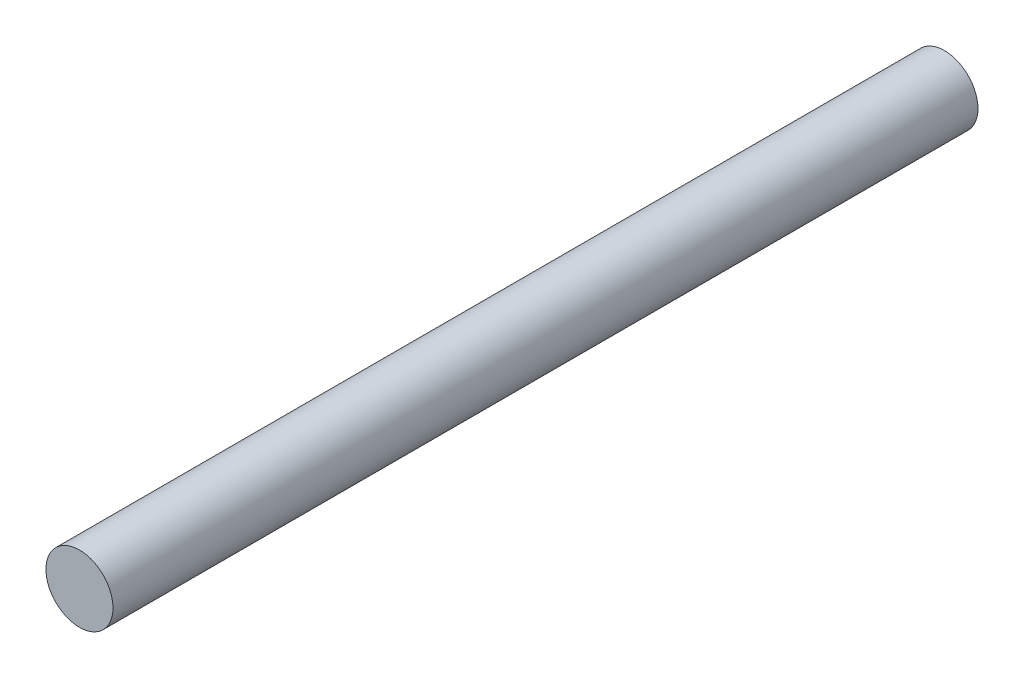
ISO-10303-21;
HEADER;
FILE_DESCRIPTION(('STEP AP214'),'2;1');
FILE_NAME('part.step','',(''),(''),'','','');
FILE_SCHEMA(('AUTOMOTIVE_DESIGN { 1 0 10303 214 1 1 1 1 }'));
ENDSEC;
DATA;
#1=APPLICATION_CONTEXT('core data for automotive mechanical design processes');
#2=APPLICATION_PROTOCOL_DEFINITION('international standard','automotive_design',2000,#1);
#3=PRODUCT_CONTEXT('',#1,'mechanical');
#4=PRODUCT('Part','Part','',(#3));
#5=PRODUCT_RELATED_PRODUCT_CATEGORY('part','',(#4));
#6=PRODUCT_DEFINITION_FORMATION('','',#4);
#7=PRODUCT_DEFINITION_CONTEXT('part definition',#1,'design');
#8=PRODUCT_DEFINITION('design','',#6,#7);
#9=PRODUCT_DEFINITION_SHAPE('','',#8);
#10=(LENGTH_UNIT() NAMED_UNIT(*) SI_UNIT(.MILLI.,.METRE.));
#11=(NAMED_UNIT(*) PLANE_ANGLE_UNIT() SI_UNIT($,.RADIAN.));
#12=(NAMED_UNIT(*) SI_UNIT($,.STERADIAN.) SOLID_ANGLE_UNIT());
#13=UNCERTAINTY_MEASURE_WITH_UNIT(LENGTH_MEASURE(1.E-05),#10,'distance_accuracy_value','');
#14=(GEOMETRIC_REPRESENTATION_CONTEXT(3) GLOBAL_UNCERTAINTY_ASSIGNED_CONTEXT((#13)) GLOBAL_UNIT_ASSIGNED_CONTEXT((#10,
#11,#12)) REPRESENTATION_CONTEXT('',''));
#15=CARTESIAN_POINT('',(0.,0.,0.));
#16=DIRECTION('',(0.,0.,1.));
#17=DIRECTION('',(1.,0.,0.));
#18=AXIS2_PLACEMENT_3D('',#15,#16,#17);
#19=CARTESIAN_POINT('',(0.,0.,25.8));
#20=DIRECTION('',(0.,0.,-1.));
#21=DIRECTION('',(-1.,0.,0.));
#22=AXIS2_PLACEMENT_3D('',#19,#20,#21);
#23=CYLINDRICAL_SURFACE('',#22,1.);
#24=CARTESIAN_POINT('',(0.,0.,25.8));
#25=DIRECTION('',(0.,0.,1.));
#26=DIRECTION('',(1.,0.,0.));
#27=AXIS2_PLACEMENT_3D('',#24,#25,#26);
#28=CIRCLE('',#27,1.);
#29=CARTESIAN_POINT('',(1.,0.,25.8));
#30=VERTEX_POINT('',#29);
#31=EDGE_CURVE('E10',#30,#30,#28,.T.);
#32=ORIENTED_EDGE('',*,*,#31,.F.);
#33=EDGE_LOOP('',(#32));
#34=FACE_BOUND('',#33,.T.);
#35=CARTESIAN_POINT('',(0.,0.,0.));
#36=DIRECTION('',(0.,0.,1.));
#37=DIRECTION('',(1.,0.,0.));
#38=AXIS2_PLACEMENT_3D('',#35,#36,#37);
#39=CIRCLE('',#38,1.);
#40=CARTESIAN_POINT('',(1.,0.,0.));
#41=VERTEX_POINT('',#40);
#42=EDGE_CURVE('E44',#41,#41,#39,.T.);
#43=ORIENTED_EDGE('',*,*,#42,.T.);
#44=EDGE_LOOP('',(#43));
#45=FACE_BOUND('',#44,.T.);
#46=ADVANCED_FACE('F41',(#34,#45),#23,.T.);
#47=CARTESIAN_POINT('',(0.,0.,25.8));
#48=DIRECTION('',(0.,0.,1.));
#49=DIRECTION('',(1.,0.,0.));
#50=AXIS2_PLACEMENT_3D('',#47,#48,#49);
#51=PLANE('',#50);
#52=ORIENTED_EDGE('',*,*,#31,.T.);
#53=EDGE_LOOP('',(#52));
#54=FACE_BOUND('',#53,.T.);
#55=ADVANCED_FACE('F58',(#54),#51,.T.);
#56=CARTESIAN_POINT('',(0.,0.,0.));
#57=DIRECTION('',(0.,0.,1.));
#58=DIRECTION('',(1.,0.,0.));
#59=AXIS2_PLACEMENT_3D('',#56,#57,#58);
#60=PLANE('',#59);
#61=ORIENTED_EDGE('',*,*,#42,.F.);
#62=EDGE_LOOP('',(#61));
#63=FACE_BOUND('',#62,.T.);
#64=ADVANCED_FACE('F56',(#63),#60,.F.);
#65=CLOSED_SHELL('',(#46,#55,#64));
#66=MANIFOLD_SOLID_BREP('B2',#65);
#67=ADVANCED_BREP_SHAPE_REPRESENTATION('',(#18,#66),#14);
#68=SHAPE_DEFINITION_REPRESENTATION(#9,#67);
ENDSEC;
END-ISO-10303-21;
